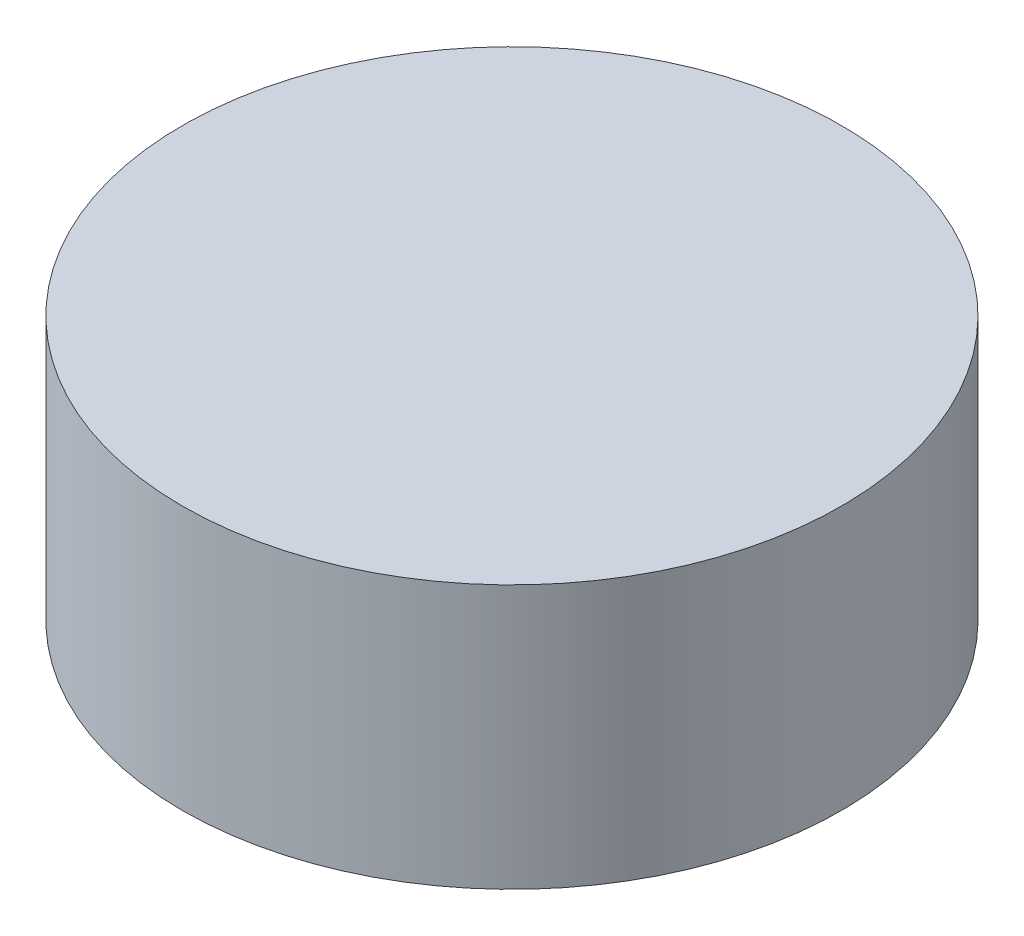
ISO-10303-21;
HEADER;
FILE_DESCRIPTION(('STEP AP214'),'2;1');
FILE_NAME('part.step','',(''),(''),'','','');
FILE_SCHEMA(('AUTOMOTIVE_DESIGN { 1 0 10303 214 1 1 1 1 }'));
ENDSEC;
DATA;
#1=APPLICATION_CONTEXT('core data for automotive mechanical design processes');
#2=APPLICATION_PROTOCOL_DEFINITION('international standard','automotive_design',2000,#1);
#3=PRODUCT_CONTEXT('',#1,'mechanical');
#4=PRODUCT('Part','Part','',(#3));
#5=PRODUCT_RELATED_PRODUCT_CATEGORY('part','',(#4));
#6=PRODUCT_DEFINITION_FORMATION('','',#4);
#7=PRODUCT_DEFINITION_CONTEXT('part definition',#1,'design');
#8=PRODUCT_DEFINITION('design','',#6,#7);
#9=PRODUCT_DEFINITION_SHAPE('','',#8);
#10=(LENGTH_UNIT() NAMED_UNIT(*) SI_UNIT(.MILLI.,.METRE.));
#11=(NAMED_UNIT(*) PLANE_ANGLE_UNIT() SI_UNIT($,.RADIAN.));
#12=(NAMED_UNIT(*) SI_UNIT($,.STERADIAN.) SOLID_ANGLE_UNIT());
#13=UNCERTAINTY_MEASURE_WITH_UNIT(LENGTH_MEASURE(1.E-05),#10,'distance_accuracy_value','');
#14=(GEOMETRIC_REPRESENTATION_CONTEXT(3) GLOBAL_UNCERTAINTY_ASSIGNED_CONTEXT((#13)) GLOBAL_UNIT_ASSIGNED_CONTEXT((#10,
#11,#12)) REPRESENTATION_CONTEXT('',''));
#15=CARTESIAN_POINT('',(0.,0.,0.));
#16=DIRECTION('',(0.,0.,1.));
#17=DIRECTION('',(1.,0.,0.));
#18=AXIS2_PLACEMENT_3D('',#15,#16,#17);
#19=CARTESIAN_POINT('',(0.,26.,0.));
#20=DIRECTION('',(0.,-1.,0.));
#21=DIRECTION('',(0.,0.,-1.));
#22=AXIS2_PLACEMENT_3D('',#19,#20,#21);
#23=CYLINDRICAL_SURFACE('',#22,32.5);
#24=CARTESIAN_POINT('',(0.,26.,0.));
#25=DIRECTION('',(0.,1.,0.));
#26=DIRECTION('',(0.,0.,1.));
#27=AXIS2_PLACEMENT_3D('',#24,#25,#26);
#28=CIRCLE('',#27,32.5);
#29=CARTESIAN_POINT('',(0.,26.,32.5));
#30=VERTEX_POINT('',#29);
#31=EDGE_CURVE('E37',#30,#30,#28,.T.);
#32=ORIENTED_EDGE('',*,*,#31,.F.);
#33=EDGE_LOOP('',(#32));
#34=FACE_BOUND('',#33,.T.);
#35=CARTESIAN_POINT('',(0.,0.,0.));
#36=DIRECTION('',(0.,1.,0.));
#37=DIRECTION('',(0.,0.,1.));
#38=AXIS2_PLACEMENT_3D('',#35,#36,#37);
#39=CIRCLE('',#38,32.5);
#40=CARTESIAN_POINT('',(0.,0.,32.5));
#41=VERTEX_POINT('',#40);
#42=EDGE_CURVE('E41',#41,#41,#39,.T.);
#43=ORIENTED_EDGE('',*,*,#42,.T.);
#44=EDGE_LOOP('',(#43));
#45=FACE_BOUND('',#44,.T.);
#46=ADVANCED_FACE('F31',(#34,#45),#23,.T.);
#47=CARTESIAN_POINT('',(0.,26.,0.));
#48=DIRECTION('',(0.,1.,0.));
#49=DIRECTION('',(0.,0.,1.));
#50=AXIS2_PLACEMENT_3D('',#47,#48,#49);
#51=PLANE('',#50);
#52=ORIENTED_EDGE('',*,*,#31,.T.);
#53=EDGE_LOOP('',(#52));
#54=FACE_BOUND('',#53,.T.);
#55=ADVANCED_FACE('F62',(#54),#51,.T.);
#56=CARTESIAN_POINT('',(0.,0.,0.));
#57=DIRECTION('',(0.,1.,0.));
#58=DIRECTION('',(0.,0.,1.));
#59=AXIS2_PLACEMENT_3D('',#56,#57,#58);
#60=PLANE('',#59);
#61=CARTESIAN_POINT('',(0.,0.,0.));
#62=DIRECTION('',(0.,1.,0.));
#63=DIRECTION('',(0.,0.,1.));
#64=AXIS2_PLACEMENT_3D('',#61,#62,#63);
#65=CIRCLE('',#64,4.);
#66=CARTESIAN_POINT('',(0.,0.,4.));
#67=VERTEX_POINT('',#66);
#68=EDGE_CURVE('E10',#67,#67,#65,.F.);
#69=ORIENTED_EDGE('',*,*,#68,.F.);
#70=EDGE_LOOP('',(#69));
#71=FACE_BOUND('',#70,.T.);
#72=ORIENTED_EDGE('',*,*,#42,.F.);
#73=EDGE_LOOP('',(#72));
#74=FACE_BOUND('',#73,.T.);
#75=ADVANCED_FACE('F55',(#71,#74),#60,.F.);
#76=CARTESIAN_POINT('',(0.,-4.5,0.));
#77=DIRECTION('',(0.,1.,0.));
#78=DIRECTION('',(0.,0.,1.));
#79=AXIS2_PLACEMENT_3D('',#76,#77,#78);
#80=CYLINDRICAL_SURFACE('',#79,4.);
#81=CARTESIAN_POINT('',(0.,-4.5,0.));
#82=DIRECTION('',(0.,-1.,0.));
#83=DIRECTION('',(0.,0.,-1.));
#84=AXIS2_PLACEMENT_3D('',#81,#82,#83);
#85=CIRCLE('',#84,4.);
#86=CARTESIAN_POINT('',(0.,-4.5,-4.));
#87=VERTEX_POINT('',#86);
#88=EDGE_CURVE('E46',#87,#87,#85,.T.);
#89=ORIENTED_EDGE('',*,*,#88,.F.);
#90=EDGE_LOOP('',(#89));
#91=FACE_BOUND('',#90,.T.);
#92=ORIENTED_EDGE('',*,*,#68,.T.);
#93=EDGE_LOOP('',(#92));
#94=FACE_BOUND('',#93,.T.);
#95=ADVANCED_FACE('F53',(#91,#94),#80,.T.);
#96=CARTESIAN_POINT('',(0.,-4.5,0.));
#97=DIRECTION('',(0.,-1.,0.));
#98=DIRECTION('',(0.,0.,-1.));
#99=AXIS2_PLACEMENT_3D('',#96,#97,#98);
#100=PLANE('',#99);
#101=ORIENTED_EDGE('',*,*,#88,.T.);
#102=EDGE_LOOP('',(#101));
#103=FACE_BOUND('',#102,.T.);
#104=ADVANCED_FACE('F51',(#103),#100,.T.);
#105=CLOSED_SHELL('',(#46,#55,#75,#95,#104));
#106=MANIFOLD_SOLID_BREP('B2',#105);
#107=ADVANCED_BREP_SHAPE_REPRESENTATION('',(#18,#106),#14);
#108=SHAPE_DEFINITION_REPRESENTATION(#9,#107);
ENDSEC;
END-ISO-10303-21;
